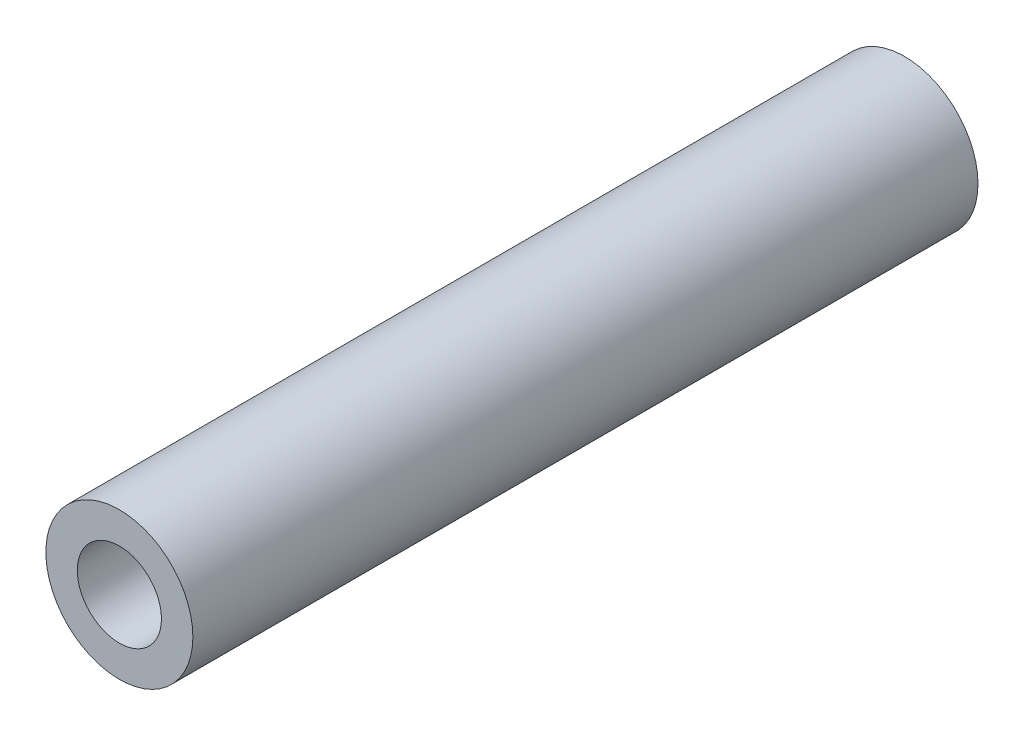
ISO-10303-21;
HEADER;
FILE_DESCRIPTION(('STEP AP214'),'2;1');
FILE_NAME('part.step','',(''),(''),'','','');
FILE_SCHEMA(('AUTOMOTIVE_DESIGN { 1 0 10303 214 1 1 1 1 }'));
ENDSEC;
DATA;
#1=APPLICATION_CONTEXT('core data for automotive mechanical design processes');
#2=APPLICATION_PROTOCOL_DEFINITION('international standard','automotive_design',2000,#1);
#3=PRODUCT_CONTEXT('',#1,'mechanical');
#4=PRODUCT('Part','Part','',(#3));
#5=PRODUCT_RELATED_PRODUCT_CATEGORY('part','',(#4));
#6=PRODUCT_DEFINITION_FORMATION('','',#4);
#7=PRODUCT_DEFINITION_CONTEXT('part definition',#1,'design');
#8=PRODUCT_DEFINITION('design','',#6,#7);
#9=PRODUCT_DEFINITION_SHAPE('','',#8);
#10=(LENGTH_UNIT() NAMED_UNIT(*) SI_UNIT(.MILLI.,.METRE.));
#11=(NAMED_UNIT(*) PLANE_ANGLE_UNIT() SI_UNIT($,.RADIAN.));
#12=(NAMED_UNIT(*) SI_UNIT($,.STERADIAN.) SOLID_ANGLE_UNIT());
#13=UNCERTAINTY_MEASURE_WITH_UNIT(LENGTH_MEASURE(1.E-05),#10,'distance_accuracy_value','');
#14=(GEOMETRIC_REPRESENTATION_CONTEXT(3) GLOBAL_UNCERTAINTY_ASSIGNED_CONTEXT((#13)) GLOBAL_UNIT_ASSIGNED_CONTEXT((#10,
#11,#12)) REPRESENTATION_CONTEXT('',''));
#15=CARTESIAN_POINT('',(0.,0.,0.));
#16=DIRECTION('',(0.,0.,1.));
#17=DIRECTION('',(1.,0.,0.));
#18=AXIS2_PLACEMENT_3D('',#15,#16,#17);
#19=CARTESIAN_POINT('',(1803.9911735505,-1743.84940911594,49.45));
#20=DIRECTION('',(0.,0.,1.));
#21=DIRECTION('',(1.,0.,0.));
#22=AXIS2_PLACEMENT_3D('',#19,#20,#21);
#23=PLANE('',#22);
#24=CARTESIAN_POINT('',(1803.9911735505,-1743.84940911594,49.45));
#25=DIRECTION('',(0.,0.,1.));
#26=DIRECTION('',(1.,0.,0.));
#27=AXIS2_PLACEMENT_3D('',#24,#25,#26);
#28=CIRCLE('',#27,4.63000000000001);
#29=CARTESIAN_POINT('',(1808.6211735505,-1743.84940911594,49.45));
#30=VERTEX_POINT('',#29);
#31=EDGE_CURVE('E10',#30,#30,#28,.T.);
#32=ORIENTED_EDGE('',*,*,#31,.T.);
#33=EDGE_LOOP('',(#32));
#34=FACE_BOUND('',#33,.T.);
#35=CARTESIAN_POINT('',(1803.9911735505,-1743.84940911594,49.45));
#36=DIRECTION('',(0.,0.,1.));
#37=DIRECTION('',(1.,0.,0.));
#38=AXIS2_PLACEMENT_3D('',#35,#36,#37);
#39=CIRCLE('',#38,2.6500000000001);
#40=CARTESIAN_POINT('',(1806.6411735505,-1743.84940911594,49.45));
#41=VERTEX_POINT('',#40);
#42=EDGE_CURVE('E41',#41,#41,#39,.T.);
#43=ORIENTED_EDGE('',*,*,#42,.F.);
#44=EDGE_LOOP('',(#43));
#45=FACE_BOUND('',#44,.T.);
#46=ADVANCED_FACE('F30',(#34,#45),#23,.T.);
#47=CARTESIAN_POINT('',(1803.9911735505,-1743.84940911594,0.));
#48=DIRECTION('',(0.,0.,1.));
#49=DIRECTION('',(1.,0.,0.));
#50=AXIS2_PLACEMENT_3D('',#47,#48,#49);
#51=PLANE('',#50);
#52=CARTESIAN_POINT('',(1803.9911735505,-1743.84940911594,0.));
#53=DIRECTION('',(0.,0.,1.));
#54=DIRECTION('',(1.,0.,0.));
#55=AXIS2_PLACEMENT_3D('',#52,#53,#54);
#56=CIRCLE('',#55,4.63000000000001);
#57=CARTESIAN_POINT('',(1808.6211735505,-1743.84940911594,0.));
#58=VERTEX_POINT('',#57);
#59=EDGE_CURVE('E34',#58,#58,#56,.T.);
#60=ORIENTED_EDGE('',*,*,#59,.F.);
#61=EDGE_LOOP('',(#60));
#62=FACE_BOUND('',#61,.T.);
#63=CARTESIAN_POINT('',(1803.9911735505,-1743.84940911594,0.));
#64=DIRECTION('',(0.,0.,1.));
#65=DIRECTION('',(1.,0.,0.));
#66=AXIS2_PLACEMENT_3D('',#63,#64,#65);
#67=CIRCLE('',#66,2.6500000000001);
#68=CARTESIAN_POINT('',(1806.6411735505,-1743.84940911594,0.));
#69=VERTEX_POINT('',#68);
#70=EDGE_CURVE('E43',#69,#69,#67,.T.);
#71=ORIENTED_EDGE('',*,*,#70,.T.);
#72=EDGE_LOOP('',(#71));
#73=FACE_BOUND('',#72,.T.);
#74=ADVANCED_FACE('F53',(#62,#73),#51,.F.);
#75=CARTESIAN_POINT('',(1803.9911735505,-1743.84940911594,49.45));
#76=DIRECTION('',(0.,0.,-1.));
#77=DIRECTION('',(-1.,0.,0.));
#78=AXIS2_PLACEMENT_3D('',#75,#76,#77);
#79=CYLINDRICAL_SURFACE('',#78,4.63000000000001);
#80=ORIENTED_EDGE('',*,*,#31,.F.);
#81=EDGE_LOOP('',(#80));
#82=FACE_BOUND('',#81,.T.);
#83=ORIENTED_EDGE('',*,*,#59,.T.);
#84=EDGE_LOOP('',(#83));
#85=FACE_BOUND('',#84,.T.);
#86=ADVANCED_FACE('F32',(#82,#85),#79,.T.);
#87=CARTESIAN_POINT('',(1803.9911735505,-1743.84940911594,49.45));
#88=DIRECTION('',(0.,0.,-1.));
#89=DIRECTION('',(-1.,0.,0.));
#90=AXIS2_PLACEMENT_3D('',#87,#88,#89);
#91=CYLINDRICAL_SURFACE('',#90,2.6500000000001);
#92=ORIENTED_EDGE('',*,*,#42,.T.);
#93=EDGE_LOOP('',(#92));
#94=FACE_BOUND('',#93,.T.);
#95=ORIENTED_EDGE('',*,*,#70,.F.);
#96=EDGE_LOOP('',(#95));
#97=FACE_BOUND('',#96,.T.);
#98=ADVANCED_FACE('F49',(#94,#97),#91,.F.);
#99=CLOSED_SHELL('',(#46,#74,#86,#98));
#100=MANIFOLD_SOLID_BREP('B2',#99);
#101=ADVANCED_BREP_SHAPE_REPRESENTATION('',(#18,#100),#14);
#102=SHAPE_DEFINITION_REPRESENTATION(#9,#101);
ENDSEC;
END-ISO-10303-21;
